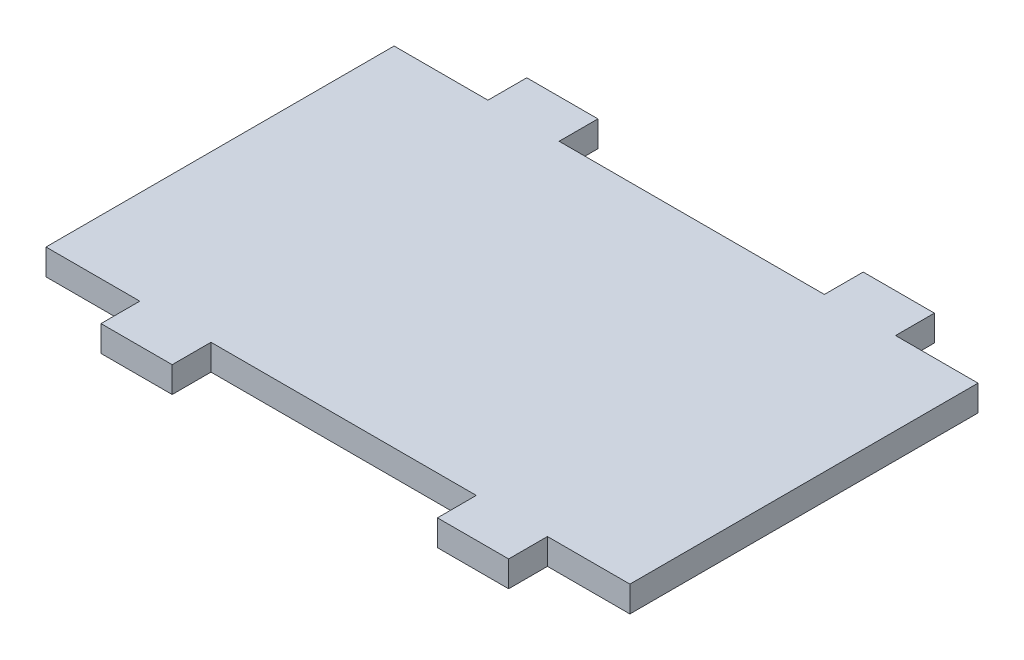
ISO-10303-21;
HEADER;
FILE_DESCRIPTION(('STEP AP214'),'2;1');
FILE_NAME('part.step','',(''),(''),'','','');
FILE_SCHEMA(('AUTOMOTIVE_DESIGN { 1 0 10303 214 1 1 1 1 }'));
ENDSEC;
DATA;
#1=APPLICATION_CONTEXT('core data for automotive mechanical design processes');
#2=APPLICATION_PROTOCOL_DEFINITION('international standard','automotive_design',2000,#1);
#3=PRODUCT_CONTEXT('',#1,'mechanical');
#4=PRODUCT('Part','Part','',(#3));
#5=PRODUCT_RELATED_PRODUCT_CATEGORY('part','',(#4));
#6=PRODUCT_DEFINITION_FORMATION('','',#4);
#7=PRODUCT_DEFINITION_CONTEXT('part definition',#1,'design');
#8=PRODUCT_DEFINITION('design','',#6,#7);
#9=PRODUCT_DEFINITION_SHAPE('','',#8);
#10=(LENGTH_UNIT() NAMED_UNIT(*) SI_UNIT(.MILLI.,.METRE.));
#11=(NAMED_UNIT(*) PLANE_ANGLE_UNIT() SI_UNIT($,.RADIAN.));
#12=(NAMED_UNIT(*) SI_UNIT($,.STERADIAN.) SOLID_ANGLE_UNIT());
#13=UNCERTAINTY_MEASURE_WITH_UNIT(LENGTH_MEASURE(1.E-05),#10,'distance_accuracy_value','');
#14=(GEOMETRIC_REPRESENTATION_CONTEXT(3) GLOBAL_UNCERTAINTY_ASSIGNED_CONTEXT((#13)) GLOBAL_UNIT_ASSIGNED_CONTEXT((#10,
#11,#12)) REPRESENTATION_CONTEXT('',''));
#15=CARTESIAN_POINT('',(0.,0.,0.));
#16=DIRECTION('',(0.,0.,1.));
#17=DIRECTION('',(1.,0.,0.));
#18=AXIS2_PLACEMENT_3D('',#15,#16,#17);
#19=CARTESIAN_POINT('',(-50.7984236509872,1.,18.7804542334295));
#20=DIRECTION('',(0.,0.,-1.));
#21=DIRECTION('',(-1.,0.,0.));
#22=AXIS2_PLACEMENT_3D('',#19,#20,#21);
#23=PLANE('',#22);
#24=DIRECTION('',(0.,-1.,0.));
#25=VECTOR('',#24,1.);
#26=CARTESIAN_POINT('',(-34.1734236509872,1.,18.7804542334295));
#27=LINE('',#26,#25);
#28=CARTESIAN_POINT('',(-34.1734236509872,1.,18.7804542334295));
#29=VERTEX_POINT('',#28);
#30=CARTESIAN_POINT('',(-34.1734236509872,0.,18.7804542334295));
#31=VERTEX_POINT('',#30);
#32=EDGE_CURVE('E58',#29,#31,#27,.T.);
#33=ORIENTED_EDGE('',*,*,#32,.F.);
#34=DIRECTION('',(1.,0.,0.));
#35=VECTOR('',#34,1.);
#36=CARTESIAN_POINT('',(-50.7984236509872,1.,18.7804542334295));
#37=LINE('',#36,#35);
#38=CARTESIAN_POINT('',(-44.4234236509872,1.,18.7804542334295));
#39=VERTEX_POINT('',#38);
#40=EDGE_CURVE('E190',#39,#29,#37,.T.);
#41=ORIENTED_EDGE('',*,*,#40,.F.);
#42=DIRECTION('',(0.,-1.,0.));
#43=VECTOR('',#42,1.);
#44=CARTESIAN_POINT('',(-44.4234236509872,1.,18.7804542334295));
#45=LINE('',#44,#43);
#46=CARTESIAN_POINT('',(-44.4234236509872,0.,18.7804542334295));
#47=VERTEX_POINT('',#46);
#48=EDGE_CURVE('E244',#39,#47,#45,.T.);
#49=ORIENTED_EDGE('',*,*,#48,.T.);
#50=DIRECTION('',(1.,0.,0.));
#51=VECTOR('',#50,1.);
#52=CARTESIAN_POINT('',(-50.7984236509872,0.,18.7804542334295));
#53=LINE('',#52,#51);
#54=EDGE_CURVE('E308',#47,#31,#53,.T.);
#55=ORIENTED_EDGE('',*,*,#54,.T.);
#56=EDGE_LOOP('',(#33,#41,#49,#55));
#57=FACE_BOUND('',#56,.T.);
#58=ADVANCED_FACE('F33',(#57),#23,.F.);
#59=DIRECTION('',(0.,-1.,0.));
#60=VECTOR('',#59,1.);
#61=CARTESIAN_POINT('',(-31.4234236509872,1.,18.7804542334295));
#62=LINE('',#61,#60);
#63=CARTESIAN_POINT('',(-31.4234236509872,1.,18.7804542334295));
#64=VERTEX_POINT('',#63);
#65=CARTESIAN_POINT('',(-31.4234236509872,0.,18.7804542334295));
#66=VERTEX_POINT('',#65);
#67=EDGE_CURVE('E201',#64,#66,#62,.T.);
#68=ORIENTED_EDGE('',*,*,#67,.T.);
#69=CARTESIAN_POINT('',(-28.2384236509872,0.,18.7804542334295));
#70=VERTEX_POINT('',#69);
#71=EDGE_CURVE('E302',#66,#70,#53,.T.);
#72=ORIENTED_EDGE('',*,*,#71,.T.);
#73=DIRECTION('',(0.,-1.,0.));
#74=VECTOR('',#73,1.);
#75=CARTESIAN_POINT('',(-28.2384236509872,1.,18.7804542334295));
#76=LINE('',#75,#74);
#77=CARTESIAN_POINT('',(-28.2384236509872,1.,18.7804542334295));
#78=VERTEX_POINT('',#77);
#79=EDGE_CURVE('E43',#78,#70,#76,.T.);
#80=ORIENTED_EDGE('',*,*,#79,.F.);
#81=EDGE_CURVE('E37',#64,#78,#37,.T.);
#82=ORIENTED_EDGE('',*,*,#81,.F.);
#83=EDGE_LOOP('',(#68,#72,#80,#82));
#84=FACE_BOUND('',#83,.T.);
#85=ADVANCED_FACE('F387',(#84),#23,.F.);
#86=CARTESIAN_POINT('',(-50.7984236509872,1.,5.33045423342954));
#87=DIRECTION('',(0.,0.,1.));
#88=DIRECTION('',(1.,0.,0.));
#89=AXIS2_PLACEMENT_3D('',#86,#87,#88);
#90=PLANE('',#89);
#91=DIRECTION('',(0.,-1.,0.));
#92=VECTOR('',#91,1.);
#93=CARTESIAN_POINT('',(-31.4234236509872,1.,5.33045423342954));
#94=LINE('',#93,#92);
#95=CARTESIAN_POINT('',(-31.4234236509872,1.,5.33045423342954));
#96=VERTEX_POINT('',#95);
#97=CARTESIAN_POINT('',(-31.4234236509872,0.,5.33045423342954));
#98=VERTEX_POINT('',#97);
#99=EDGE_CURVE('E225',#96,#98,#94,.T.);
#100=ORIENTED_EDGE('',*,*,#99,.F.);
#101=DIRECTION('',(-1.,0.,0.));
#102=VECTOR('',#101,1.);
#103=CARTESIAN_POINT('',(-50.7984236509872,1.,5.33045423342954));
#104=LINE('',#103,#102);
#105=CARTESIAN_POINT('',(-28.2384236509872,1.,5.33045423342954));
#106=VERTEX_POINT('',#105);
#107=EDGE_CURVE('E284',#106,#96,#104,.T.);
#108=ORIENTED_EDGE('',*,*,#107,.F.);
#109=DIRECTION('',(0.,-1.,0.));
#110=VECTOR('',#109,1.);
#111=CARTESIAN_POINT('',(-28.2384236509872,1.,5.33045423342954));
#112=LINE('',#111,#110);
#113=CARTESIAN_POINT('',(-28.2384236509872,0.,5.33045423342954));
#114=VERTEX_POINT('',#113);
#115=EDGE_CURVE('E277',#106,#114,#112,.T.);
#116=ORIENTED_EDGE('',*,*,#115,.T.);
#117=DIRECTION('',(-1.,0.,0.));
#118=VECTOR('',#117,1.);
#119=CARTESIAN_POINT('',(-50.7984236509872,0.,5.33045423342954));
#120=LINE('',#119,#118);
#121=EDGE_CURVE('E258',#114,#98,#120,.T.);
#122=ORIENTED_EDGE('',*,*,#121,.T.);
#123=EDGE_LOOP('',(#100,#108,#116,#122));
#124=FACE_BOUND('',#123,.T.);
#125=ADVANCED_FACE('F392',(#124),#90,.F.);
#126=DIRECTION('',(0.,-1.,0.));
#127=VECTOR('',#126,1.);
#128=CARTESIAN_POINT('',(-34.1734236509872,1.,5.33045423342954));
#129=LINE('',#128,#127);
#130=CARTESIAN_POINT('',(-34.1734236509872,1.,5.33045423342954));
#131=VERTEX_POINT('',#130);
#132=CARTESIAN_POINT('',(-34.1734236509872,0.,5.33045423342954));
#133=VERTEX_POINT('',#132);
#134=EDGE_CURVE('E212',#131,#133,#129,.T.);
#135=ORIENTED_EDGE('',*,*,#134,.T.);
#136=CARTESIAN_POINT('',(-44.4234236509872,0.,5.33045423342954));
#137=VERTEX_POINT('',#136);
#138=EDGE_CURVE('E255',#133,#137,#120,.T.);
#139=ORIENTED_EDGE('',*,*,#138,.T.);
#140=DIRECTION('',(0.,-1.,0.));
#141=VECTOR('',#140,1.);
#142=CARTESIAN_POINT('',(-44.4234236509872,1.,5.33045423342954));
#143=LINE('',#142,#141);
#144=CARTESIAN_POINT('',(-44.4234236509872,1.,5.33045423342954));
#145=VERTEX_POINT('',#144);
#146=EDGE_CURVE('E326',#145,#137,#143,.T.);
#147=ORIENTED_EDGE('',*,*,#146,.F.);
#148=EDGE_CURVE('E260',#131,#145,#104,.T.);
#149=ORIENTED_EDGE('',*,*,#148,.F.);
#150=EDGE_LOOP('',(#135,#139,#147,#149));
#151=FACE_BOUND('',#150,.T.);
#152=ADVANCED_FACE('F395',(#151),#90,.F.);
#153=DIRECTION('',(0.,-1.,0.));
#154=VECTOR('',#153,1.);
#155=CARTESIAN_POINT('',(-47.1734236509872,1.,18.7804542334295));
#156=LINE('',#155,#154);
#157=CARTESIAN_POINT('',(-47.1734236509872,1.,18.7804542334295));
#158=VERTEX_POINT('',#157);
#159=CARTESIAN_POINT('',(-47.1734236509872,0.,18.7804542334295));
#160=VERTEX_POINT('',#159);
#161=EDGE_CURVE('E241',#158,#160,#156,.T.);
#162=ORIENTED_EDGE('',*,*,#161,.F.);
#163=CARTESIAN_POINT('',(-50.7984236509872,1.,18.7804542334295));
#164=VERTEX_POINT('',#163);
#165=EDGE_CURVE('E365',#164,#158,#37,.T.);
#166=ORIENTED_EDGE('',*,*,#165,.F.);
#167=DIRECTION('',(0.,-1.,0.));
#168=VECTOR('',#167,1.);
#169=CARTESIAN_POINT('',(-50.7984236509872,1.,18.7804542334295));
#170=LINE('',#169,#168);
#171=CARTESIAN_POINT('',(-50.7984236509872,0.,18.7804542334295));
#172=VERTEX_POINT('',#171);
#173=EDGE_CURVE('E11',#164,#172,#170,.T.);
#174=ORIENTED_EDGE('',*,*,#173,.T.);
#175=EDGE_CURVE('E311',#172,#160,#53,.T.);
#176=ORIENTED_EDGE('',*,*,#175,.T.);
#177=EDGE_LOOP('',(#162,#166,#174,#176));
#178=FACE_BOUND('',#177,.T.);
#179=ADVANCED_FACE('F388',(#178),#23,.F.);
#180=CARTESIAN_POINT('',(-50.7984236509872,1.,5.33045423342954));
#181=DIRECTION('',(1.,0.,0.));
#182=DIRECTION('',(0.,0.,-1.));
#183=AXIS2_PLACEMENT_3D('',#180,#181,#182);
#184=PLANE('',#183);
#185=DIRECTION('',(0.,0.,1.));
#186=VECTOR('',#185,1.);
#187=CARTESIAN_POINT('',(-50.7984236509872,0.,5.33045423342954));
#188=LINE('',#187,#186);
#189=CARTESIAN_POINT('',(-50.7984236509872,0.,5.33045423342954));
#190=VERTEX_POINT('',#189);
#191=EDGE_CURVE('E299',#190,#172,#188,.T.);
#192=ORIENTED_EDGE('',*,*,#191,.T.);
#193=ORIENTED_EDGE('',*,*,#173,.F.);
#194=DIRECTION('',(0.,0.,1.));
#195=VECTOR('',#194,1.);
#196=CARTESIAN_POINT('',(-50.7984236509872,1.,5.33045423342954));
#197=LINE('',#196,#195);
#198=CARTESIAN_POINT('',(-50.7984236509872,1.,5.33045423342954));
#199=VERTEX_POINT('',#198);
#200=EDGE_CURVE('E274',#199,#164,#197,.T.);
#201=ORIENTED_EDGE('',*,*,#200,.F.);
#202=DIRECTION('',(0.,-1.,0.));
#203=VECTOR('',#202,1.);
#204=CARTESIAN_POINT('',(-50.7984236509872,1.,5.33045423342954));
#205=LINE('',#204,#203);
#206=EDGE_CURVE('E267',#199,#190,#205,.T.);
#207=ORIENTED_EDGE('',*,*,#206,.T.);
#208=EDGE_LOOP('',(#192,#193,#201,#207));
#209=FACE_BOUND('',#208,.T.);
#210=ADVANCED_FACE('F35',(#209),#184,.F.);
#211=CARTESIAN_POINT('',(-28.2384236509872,1.,5.33045423342954));
#212=DIRECTION('',(-1.,0.,0.));
#213=DIRECTION('',(0.,0.,1.));
#214=AXIS2_PLACEMENT_3D('',#211,#212,#213);
#215=PLANE('',#214);
#216=DIRECTION('',(0.,0.,-1.));
#217=VECTOR('',#216,1.);
#218=CARTESIAN_POINT('',(-28.2384236509872,0.,5.33045423342954));
#219=LINE('',#218,#217);
#220=EDGE_CURVE('E265',#70,#114,#219,.T.);
#221=ORIENTED_EDGE('',*,*,#220,.T.);
#222=ORIENTED_EDGE('',*,*,#115,.F.);
#223=DIRECTION('',(0.,0.,-1.));
#224=VECTOR('',#223,1.);
#225=CARTESIAN_POINT('',(-28.2384236509872,1.,5.33045423342954));
#226=LINE('',#225,#224);
#227=EDGE_CURVE('E298',#78,#106,#226,.T.);
#228=ORIENTED_EDGE('',*,*,#227,.F.);
#229=ORIENTED_EDGE('',*,*,#79,.T.);
#230=EDGE_LOOP('',(#221,#222,#228,#229));
#231=FACE_BOUND('',#230,.T.);
#232=ADVANCED_FACE('F401',(#231),#215,.F.);
#233=CARTESIAN_POINT('',(-47.1734236509872,1.,5.33045423342954));
#234=VERTEX_POINT('',#233);
#235=EDGE_CURVE('E292',#234,#199,#104,.T.);
#236=ORIENTED_EDGE('',*,*,#235,.F.);
#237=DIRECTION('',(0.,-1.,0.));
#238=VECTOR('',#237,1.);
#239=CARTESIAN_POINT('',(-47.1734236509872,1.,5.33045423342954));
#240=LINE('',#239,#238);
#241=CARTESIAN_POINT('',(-47.1734236509872,0.,5.33045423342954));
#242=VERTEX_POINT('',#241);
#243=EDGE_CURVE('E303',#234,#242,#240,.T.);
#244=ORIENTED_EDGE('',*,*,#243,.T.);
#245=EDGE_CURVE('E259',#242,#190,#120,.T.);
#246=ORIENTED_EDGE('',*,*,#245,.T.);
#247=ORIENTED_EDGE('',*,*,#206,.F.);
#248=EDGE_LOOP('',(#236,#244,#246,#247));
#249=FACE_BOUND('',#248,.T.);
#250=ADVANCED_FACE('F364',(#249),#90,.F.);
#251=CARTESIAN_POINT('',(0.,1.,0.));
#252=DIRECTION('',(0.,1.,0.));
#253=DIRECTION('',(0.,0.,1.));
#254=AXIS2_PLACEMENT_3D('',#251,#252,#253);
#255=PLANE('',#254);
#256=ORIENTED_EDGE('',*,*,#200,.T.);
#257=ORIENTED_EDGE('',*,*,#165,.T.);
#258=DIRECTION('',(0.,0.,1.));
#259=VECTOR('',#258,1.);
#260=CARTESIAN_POINT('',(-47.1734236509872,1.,18.7804542334295));
#261=LINE('',#260,#259);
#262=CARTESIAN_POINT('',(-47.1734236509872,1.,20.2804542334295));
#263=VERTEX_POINT('',#262);
#264=EDGE_CURVE('E232',#158,#263,#261,.T.);
#265=ORIENTED_EDGE('',*,*,#264,.T.);
#266=DIRECTION('',(1.,0.,0.));
#267=VECTOR('',#266,1.);
#268=CARTESIAN_POINT('',(-47.1734236509872,1.,20.2804542334295));
#269=LINE('',#268,#267);
#270=CARTESIAN_POINT('',(-44.4234236509872,1.,20.2804542334295));
#271=VERTEX_POINT('',#270);
#272=EDGE_CURVE('E229',#263,#271,#269,.T.);
#273=ORIENTED_EDGE('',*,*,#272,.T.);
#274=DIRECTION('',(0.,0.,-1.));
#275=VECTOR('',#274,1.);
#276=CARTESIAN_POINT('',(-44.4234236509872,1.,18.7804542334295));
#277=LINE('',#276,#275);
#278=EDGE_CURVE('E231',#271,#39,#277,.T.);
#279=ORIENTED_EDGE('',*,*,#278,.T.);
#280=ORIENTED_EDGE('',*,*,#40,.T.);
#281=DIRECTION('',(0.,0.,1.));
#282=VECTOR('',#281,1.);
#283=CARTESIAN_POINT('',(-34.1734236509872,1.,18.7804542334295));
#284=LINE('',#283,#282);
#285=CARTESIAN_POINT('',(-34.1734236509872,1.,20.2804542334295));
#286=VERTEX_POINT('',#285);
#287=EDGE_CURVE('E185',#29,#286,#284,.T.);
#288=ORIENTED_EDGE('',*,*,#287,.T.);
#289=DIRECTION('',(1.,0.,0.));
#290=VECTOR('',#289,1.);
#291=CARTESIAN_POINT('',(-34.1734236509872,1.,20.2804542334295));
#292=LINE('',#291,#290);
#293=CARTESIAN_POINT('',(-31.4234236509872,1.,20.2804542334295));
#294=VERTEX_POINT('',#293);
#295=EDGE_CURVE('E174',#286,#294,#292,.T.);
#296=ORIENTED_EDGE('',*,*,#295,.T.);
#297=DIRECTION('',(0.,0.,-1.));
#298=VECTOR('',#297,1.);
#299=CARTESIAN_POINT('',(-31.4234236509872,1.,18.7804542334295));
#300=LINE('',#299,#298);
#301=EDGE_CURVE('E184',#294,#64,#300,.T.);
#302=ORIENTED_EDGE('',*,*,#301,.T.);
#303=ORIENTED_EDGE('',*,*,#81,.T.);
#304=ORIENTED_EDGE('',*,*,#227,.T.);
#305=ORIENTED_EDGE('',*,*,#107,.T.);
#306=DIRECTION('',(0.,0.,-1.));
#307=VECTOR('',#306,1.);
#308=CARTESIAN_POINT('',(-31.4234236509872,1.,5.33045423342954));
#309=LINE('',#308,#307);
#310=CARTESIAN_POINT('',(-31.4234236509872,1.,3.83045423342955));
#311=VERTEX_POINT('',#310);
#312=EDGE_CURVE('E205',#96,#311,#309,.T.);
#313=ORIENTED_EDGE('',*,*,#312,.T.);
#314=DIRECTION('',(-1.,0.,0.));
#315=VECTOR('',#314,1.);
#316=CARTESIAN_POINT('',(-34.1734236509872,1.,3.83045423342955));
#317=LINE('',#316,#315);
#318=CARTESIAN_POINT('',(-34.1734236509872,1.,3.83045423342955));
#319=VERTEX_POINT('',#318);
#320=EDGE_CURVE('E207',#311,#319,#317,.T.);
#321=ORIENTED_EDGE('',*,*,#320,.T.);
#322=DIRECTION('',(0.,0.,1.));
#323=VECTOR('',#322,1.);
#324=CARTESIAN_POINT('',(-34.1734236509872,1.,5.33045423342954));
#325=LINE('',#324,#323);
#326=EDGE_CURVE('E210',#319,#131,#325,.T.);
#327=ORIENTED_EDGE('',*,*,#326,.T.);
#328=ORIENTED_EDGE('',*,*,#148,.T.);
#329=DIRECTION('',(0.,0.,-1.));
#330=VECTOR('',#329,1.);
#331=CARTESIAN_POINT('',(-44.4234236509872,1.,5.33045423342954));
#332=LINE('',#331,#330);
#333=CARTESIAN_POINT('',(-44.4234236509872,1.,3.83045423342955));
#334=VERTEX_POINT('',#333);
#335=EDGE_CURVE('E322',#145,#334,#332,.T.);
#336=ORIENTED_EDGE('',*,*,#335,.T.);
#337=DIRECTION('',(-1.,0.,0.));
#338=VECTOR('',#337,1.);
#339=CARTESIAN_POINT('',(-47.1734236509872,1.,3.83045423342955));
#340=LINE('',#339,#338);
#341=CARTESIAN_POINT('',(-47.1734236509872,1.,3.83045423342955));
#342=VERTEX_POINT('',#341);
#343=EDGE_CURVE('E324',#334,#342,#340,.T.);
#344=ORIENTED_EDGE('',*,*,#343,.T.);
#345=DIRECTION('',(0.,0.,1.));
#346=VECTOR('',#345,1.);
#347=CARTESIAN_POINT('',(-47.1734236509872,1.,5.33045423342954));
#348=LINE('',#347,#346);
#349=EDGE_CURVE('E325',#342,#234,#348,.T.);
#350=ORIENTED_EDGE('',*,*,#349,.T.);
#351=ORIENTED_EDGE('',*,*,#235,.T.);
#352=EDGE_LOOP('',(#256,#257,#265,#273,#279,#280,#288,#296,#302,#303,#304,#305,#313,#321,#327,
#328,#336,#344,#350,#351));
#353=FACE_BOUND('',#352,.T.);
#354=ADVANCED_FACE('F189',(#353),#255,.T.);
#355=CARTESIAN_POINT('',(0.,0.,0.));
#356=DIRECTION('',(0.,1.,0.));
#357=DIRECTION('',(0.,0.,1.));
#358=AXIS2_PLACEMENT_3D('',#355,#356,#357);
#359=PLANE('',#358);
#360=ORIENTED_EDGE('',*,*,#191,.F.);
#361=ORIENTED_EDGE('',*,*,#245,.F.);
#362=DIRECTION('',(0.,0.,1.));
#363=VECTOR('',#362,1.);
#364=CARTESIAN_POINT('',(-47.1734236509872,0.,5.33045423342954));
#365=LINE('',#364,#363);
#366=CARTESIAN_POINT('',(-47.1734236509872,0.,3.83045423342955));
#367=VERTEX_POINT('',#366);
#368=EDGE_CURVE('E319',#367,#242,#365,.T.);
#369=ORIENTED_EDGE('',*,*,#368,.F.);
#370=DIRECTION('',(-1.,0.,0.));
#371=VECTOR('',#370,1.);
#372=CARTESIAN_POINT('',(-47.1734236509872,0.,3.83045423342955));
#373=LINE('',#372,#371);
#374=CARTESIAN_POINT('',(-44.4234236509872,0.,3.83045423342955));
#375=VERTEX_POINT('',#374);
#376=EDGE_CURVE('E318',#375,#367,#373,.T.);
#377=ORIENTED_EDGE('',*,*,#376,.F.);
#378=DIRECTION('',(0.,0.,-1.));
#379=VECTOR('',#378,1.);
#380=CARTESIAN_POINT('',(-44.4234236509872,0.,5.33045423342954));
#381=LINE('',#380,#379);
#382=EDGE_CURVE('E316',#137,#375,#381,.T.);
#383=ORIENTED_EDGE('',*,*,#382,.F.);
#384=ORIENTED_EDGE('',*,*,#138,.F.);
#385=DIRECTION('',(0.,0.,1.));
#386=VECTOR('',#385,1.);
#387=CARTESIAN_POINT('',(-34.1734236509872,0.,5.33045423342954));
#388=LINE('',#387,#386);
#389=CARTESIAN_POINT('',(-34.1734236509872,0.,3.83045423342955));
#390=VERTEX_POINT('',#389);
#391=EDGE_CURVE('E208',#390,#133,#388,.T.);
#392=ORIENTED_EDGE('',*,*,#391,.F.);
#393=DIRECTION('',(-1.,0.,0.));
#394=VECTOR('',#393,1.);
#395=CARTESIAN_POINT('',(-34.1734236509872,0.,3.83045423342955));
#396=LINE('',#395,#394);
#397=CARTESIAN_POINT('',(-31.4234236509872,0.,3.83045423342955));
#398=VERTEX_POINT('',#397);
#399=EDGE_CURVE('E199',#398,#390,#396,.T.);
#400=ORIENTED_EDGE('',*,*,#399,.F.);
#401=DIRECTION('',(0.,0.,-1.));
#402=VECTOR('',#401,1.);
#403=CARTESIAN_POINT('',(-31.4234236509872,0.,5.33045423342954));
#404=LINE('',#403,#402);
#405=EDGE_CURVE('E197',#98,#398,#404,.T.);
#406=ORIENTED_EDGE('',*,*,#405,.F.);
#407=ORIENTED_EDGE('',*,*,#121,.F.);
#408=ORIENTED_EDGE('',*,*,#220,.F.);
#409=ORIENTED_EDGE('',*,*,#71,.F.);
#410=DIRECTION('',(0.,0.,-1.));
#411=VECTOR('',#410,1.);
#412=CARTESIAN_POINT('',(-31.4234236509872,0.,18.7804542334295));
#413=LINE('',#412,#411);
#414=CARTESIAN_POINT('',(-31.4234236509872,0.,20.2804542334295));
#415=VERTEX_POINT('',#414);
#416=EDGE_CURVE('E192',#415,#66,#413,.T.);
#417=ORIENTED_EDGE('',*,*,#416,.F.);
#418=DIRECTION('',(1.,0.,0.));
#419=VECTOR('',#418,1.);
#420=CARTESIAN_POINT('',(-34.1734236509872,0.,20.2804542334295));
#421=LINE('',#420,#419);
#422=CARTESIAN_POINT('',(-34.1734236509872,0.,20.2804542334295));
#423=VERTEX_POINT('',#422);
#424=EDGE_CURVE('E448',#423,#415,#421,.T.);
#425=ORIENTED_EDGE('',*,*,#424,.F.);
#426=DIRECTION('',(0.,0.,1.));
#427=VECTOR('',#426,1.);
#428=CARTESIAN_POINT('',(-34.1734236509872,0.,18.7804542334295));
#429=LINE('',#428,#427);
#430=EDGE_CURVE('E196',#31,#423,#429,.T.);
#431=ORIENTED_EDGE('',*,*,#430,.F.);
#432=ORIENTED_EDGE('',*,*,#54,.F.);
#433=DIRECTION('',(0.,0.,-1.));
#434=VECTOR('',#433,1.);
#435=CARTESIAN_POINT('',(-44.4234236509872,0.,18.7804542334295));
#436=LINE('',#435,#434);
#437=CARTESIAN_POINT('',(-44.4234236509872,0.,20.2804542334295));
#438=VERTEX_POINT('',#437);
#439=EDGE_CURVE('E235',#438,#47,#436,.T.);
#440=ORIENTED_EDGE('',*,*,#439,.F.);
#441=DIRECTION('',(1.,0.,0.));
#442=VECTOR('',#441,1.);
#443=CARTESIAN_POINT('',(-47.1734236509872,0.,20.2804542334295));
#444=LINE('',#443,#442);
#445=CARTESIAN_POINT('',(-47.1734236509872,0.,20.2804542334295));
#446=VERTEX_POINT('',#445);
#447=EDGE_CURVE('E233',#446,#438,#444,.T.);
#448=ORIENTED_EDGE('',*,*,#447,.F.);
#449=DIRECTION('',(0.,0.,1.));
#450=VECTOR('',#449,1.);
#451=CARTESIAN_POINT('',(-47.1734236509872,0.,18.7804542334295));
#452=LINE('',#451,#450);
#453=EDGE_CURVE('E228',#160,#446,#452,.T.);
#454=ORIENTED_EDGE('',*,*,#453,.F.);
#455=ORIENTED_EDGE('',*,*,#175,.F.);
#456=EDGE_LOOP('',(#360,#361,#369,#377,#383,#384,#392,#400,#406,#407,#408,#409,#417,#425,#431,
#432,#440,#448,#454,#455));
#457=FACE_BOUND('',#456,.T.);
#458=ADVANCED_FACE('F410',(#457),#359,.F.);
#459=CARTESIAN_POINT('',(-47.1734236509872,1.,5.33045423342954));
#460=DIRECTION('',(1.,0.,0.));
#461=DIRECTION('',(0.,0.,-1.));
#462=AXIS2_PLACEMENT_3D('',#459,#460,#461);
#463=PLANE('',#462);
#464=ORIENTED_EDGE('',*,*,#368,.T.);
#465=ORIENTED_EDGE('',*,*,#243,.F.);
#466=ORIENTED_EDGE('',*,*,#349,.F.);
#467=DIRECTION('',(0.,-1.,0.));
#468=VECTOR('',#467,1.);
#469=CARTESIAN_POINT('',(-47.1734236509872,1.,3.83045423342955));
#470=LINE('',#469,#468);
#471=EDGE_CURVE('E353',#342,#367,#470,.T.);
#472=ORIENTED_EDGE('',*,*,#471,.T.);
#473=EDGE_LOOP('',(#464,#465,#466,#472));
#474=FACE_BOUND('',#473,.T.);
#475=ADVANCED_FACE('F360',(#474),#463,.F.);
#476=CARTESIAN_POINT('',(-44.4234236509872,1.,5.33045423342954));
#477=DIRECTION('',(-1.,0.,0.));
#478=DIRECTION('',(0.,0.,1.));
#479=AXIS2_PLACEMENT_3D('',#476,#477,#478);
#480=PLANE('',#479);
#481=ORIENTED_EDGE('',*,*,#382,.T.);
#482=DIRECTION('',(0.,-1.,0.));
#483=VECTOR('',#482,1.);
#484=CARTESIAN_POINT('',(-44.4234236509872,1.,3.83045423342955));
#485=LINE('',#484,#483);
#486=EDGE_CURVE('E330',#334,#375,#485,.T.);
#487=ORIENTED_EDGE('',*,*,#486,.F.);
#488=ORIENTED_EDGE('',*,*,#335,.F.);
#489=ORIENTED_EDGE('',*,*,#146,.T.);
#490=EDGE_LOOP('',(#481,#487,#488,#489));
#491=FACE_BOUND('',#490,.T.);
#492=ADVANCED_FACE('F428',(#491),#480,.F.);
#493=CARTESIAN_POINT('',(-47.1734236509872,1.,3.83045423342955));
#494=DIRECTION('',(0.,0.,1.));
#495=DIRECTION('',(1.,0.,0.));
#496=AXIS2_PLACEMENT_3D('',#493,#494,#495);
#497=PLANE('',#496);
#498=ORIENTED_EDGE('',*,*,#376,.T.);
#499=ORIENTED_EDGE('',*,*,#471,.F.);
#500=ORIENTED_EDGE('',*,*,#343,.F.);
#501=ORIENTED_EDGE('',*,*,#486,.T.);
#502=EDGE_LOOP('',(#498,#499,#500,#501));
#503=FACE_BOUND('',#502,.T.);
#504=ADVANCED_FACE('F359',(#503),#497,.F.);
#505=CARTESIAN_POINT('',(-47.1734236509872,1.,18.7804542334295));
#506=DIRECTION('',(1.,0.,0.));
#507=DIRECTION('',(0.,0.,-1.));
#508=AXIS2_PLACEMENT_3D('',#505,#506,#507);
#509=PLANE('',#508);
#510=ORIENTED_EDGE('',*,*,#453,.T.);
#511=DIRECTION('',(0.,-1.,0.));
#512=VECTOR('',#511,1.);
#513=CARTESIAN_POINT('',(-47.1734236509872,1.,20.2804542334295));
#514=LINE('',#513,#512);
#515=EDGE_CURVE('E413',#263,#446,#514,.T.);
#516=ORIENTED_EDGE('',*,*,#515,.F.);
#517=ORIENTED_EDGE('',*,*,#264,.F.);
#518=ORIENTED_EDGE('',*,*,#161,.T.);
#519=EDGE_LOOP('',(#510,#516,#517,#518));
#520=FACE_BOUND('',#519,.T.);
#521=ADVANCED_FACE('F407',(#520),#509,.F.);
#522=CARTESIAN_POINT('',(-47.1734236509872,1.,20.2804542334295));
#523=DIRECTION('',(0.,0.,-1.));
#524=DIRECTION('',(-1.,0.,0.));
#525=AXIS2_PLACEMENT_3D('',#522,#523,#524);
#526=PLANE('',#525);
#527=ORIENTED_EDGE('',*,*,#447,.T.);
#528=DIRECTION('',(0.,-1.,0.));
#529=VECTOR('',#528,1.);
#530=CARTESIAN_POINT('',(-44.4234236509872,1.,20.2804542334295));
#531=LINE('',#530,#529);
#532=EDGE_CURVE('E375',#271,#438,#531,.T.);
#533=ORIENTED_EDGE('',*,*,#532,.F.);
#534=ORIENTED_EDGE('',*,*,#272,.F.);
#535=ORIENTED_EDGE('',*,*,#515,.T.);
#536=EDGE_LOOP('',(#527,#533,#534,#535));
#537=FACE_BOUND('',#536,.T.);
#538=ADVANCED_FACE('F414',(#537),#526,.F.);
#539=CARTESIAN_POINT('',(-44.4234236509872,1.,18.7804542334295));
#540=DIRECTION('',(-1.,0.,0.));
#541=DIRECTION('',(0.,0.,1.));
#542=AXIS2_PLACEMENT_3D('',#539,#540,#541);
#543=PLANE('',#542);
#544=ORIENTED_EDGE('',*,*,#439,.T.);
#545=ORIENTED_EDGE('',*,*,#48,.F.);
#546=ORIENTED_EDGE('',*,*,#278,.F.);
#547=ORIENTED_EDGE('',*,*,#532,.T.);
#548=EDGE_LOOP('',(#544,#545,#546,#547));
#549=FACE_BOUND('',#548,.T.);
#550=ADVANCED_FACE('F383',(#549),#543,.F.);
#551=CARTESIAN_POINT('',(-31.4234236509872,1.,5.33045423342954));
#552=DIRECTION('',(-1.,0.,0.));
#553=DIRECTION('',(0.,0.,1.));
#554=AXIS2_PLACEMENT_3D('',#551,#552,#553);
#555=PLANE('',#554);
#556=ORIENTED_EDGE('',*,*,#405,.T.);
#557=DIRECTION('',(0.,-1.,0.));
#558=VECTOR('',#557,1.);
#559=CARTESIAN_POINT('',(-31.4234236509872,1.,3.83045423342955));
#560=LINE('',#559,#558);
#561=EDGE_CURVE('E222',#311,#398,#560,.T.);
#562=ORIENTED_EDGE('',*,*,#561,.F.);
#563=ORIENTED_EDGE('',*,*,#312,.F.);
#564=ORIENTED_EDGE('',*,*,#99,.T.);
#565=EDGE_LOOP('',(#556,#562,#563,#564));
#566=FACE_BOUND('',#565,.T.);
#567=ADVANCED_FACE('F421',(#566),#555,.F.);
#568=CARTESIAN_POINT('',(-34.1734236509872,1.,3.83045423342955));
#569=DIRECTION('',(0.,0.,1.));
#570=DIRECTION('',(1.,0.,0.));
#571=AXIS2_PLACEMENT_3D('',#568,#569,#570);
#572=PLANE('',#571);
#573=ORIENTED_EDGE('',*,*,#399,.T.);
#574=DIRECTION('',(0.,-1.,0.));
#575=VECTOR('',#574,1.);
#576=CARTESIAN_POINT('',(-34.1734236509872,1.,3.83045423342955));
#577=LINE('',#576,#575);
#578=EDGE_CURVE('E219',#319,#390,#577,.T.);
#579=ORIENTED_EDGE('',*,*,#578,.F.);
#580=ORIENTED_EDGE('',*,*,#320,.F.);
#581=ORIENTED_EDGE('',*,*,#561,.T.);
#582=EDGE_LOOP('',(#573,#579,#580,#581));
#583=FACE_BOUND('',#582,.T.);
#584=ADVANCED_FACE('F467',(#583),#572,.F.);
#585=CARTESIAN_POINT('',(-34.1734236509872,1.,5.33045423342954));
#586=DIRECTION('',(1.,0.,0.));
#587=DIRECTION('',(0.,0.,-1.));
#588=AXIS2_PLACEMENT_3D('',#585,#586,#587);
#589=PLANE('',#588);
#590=ORIENTED_EDGE('',*,*,#391,.T.);
#591=ORIENTED_EDGE('',*,*,#134,.F.);
#592=ORIENTED_EDGE('',*,*,#326,.F.);
#593=ORIENTED_EDGE('',*,*,#578,.T.);
#594=EDGE_LOOP('',(#590,#591,#592,#593));
#595=FACE_BOUND('',#594,.T.);
#596=ADVANCED_FACE('F464',(#595),#589,.F.);
#597=CARTESIAN_POINT('',(-34.1734236509872,1.,18.7804542334295));
#598=DIRECTION('',(1.,0.,0.));
#599=DIRECTION('',(0.,0.,-1.));
#600=AXIS2_PLACEMENT_3D('',#597,#598,#599);
#601=PLANE('',#600);
#602=ORIENTED_EDGE('',*,*,#430,.T.);
#603=DIRECTION('',(0.,-1.,0.));
#604=VECTOR('',#603,1.);
#605=CARTESIAN_POINT('',(-34.1734236509872,1.,20.2804542334295));
#606=LINE('',#605,#604);
#607=EDGE_CURVE('E178',#286,#423,#606,.T.);
#608=ORIENTED_EDGE('',*,*,#607,.F.);
#609=ORIENTED_EDGE('',*,*,#287,.F.);
#610=ORIENTED_EDGE('',*,*,#32,.T.);
#611=EDGE_LOOP('',(#602,#608,#609,#610));
#612=FACE_BOUND('',#611,.T.);
#613=ADVANCED_FACE('F194',(#612),#601,.F.);
#614=CARTESIAN_POINT('',(-34.1734236509872,1.,20.2804542334295));
#615=DIRECTION('',(0.,0.,-1.));
#616=DIRECTION('',(-1.,0.,0.));
#617=AXIS2_PLACEMENT_3D('',#614,#615,#616);
#618=PLANE('',#617);
#619=ORIENTED_EDGE('',*,*,#424,.T.);
#620=DIRECTION('',(0.,-1.,0.));
#621=VECTOR('',#620,1.);
#622=CARTESIAN_POINT('',(-31.4234236509872,1.,20.2804542334295));
#623=LINE('',#622,#621);
#624=EDGE_CURVE('E181',#294,#415,#623,.T.);
#625=ORIENTED_EDGE('',*,*,#624,.F.);
#626=ORIENTED_EDGE('',*,*,#295,.F.);
#627=ORIENTED_EDGE('',*,*,#607,.T.);
#628=EDGE_LOOP('',(#619,#625,#626,#627));
#629=FACE_BOUND('',#628,.T.);
#630=ADVANCED_FACE('F176',(#629),#618,.F.);
#631=CARTESIAN_POINT('',(-31.4234236509872,1.,18.7804542334295));
#632=DIRECTION('',(-1.,0.,0.));
#633=DIRECTION('',(0.,0.,1.));
#634=AXIS2_PLACEMENT_3D('',#631,#632,#633);
#635=PLANE('',#634);
#636=ORIENTED_EDGE('',*,*,#416,.T.);
#637=ORIENTED_EDGE('',*,*,#67,.F.);
#638=ORIENTED_EDGE('',*,*,#301,.F.);
#639=ORIENTED_EDGE('',*,*,#624,.T.);
#640=EDGE_LOOP('',(#636,#637,#638,#639));
#641=FACE_BOUND('',#640,.T.);
#642=ADVANCED_FACE('F454',(#641),#635,.F.);
#643=CLOSED_SHELL('',(#58,#85,#125,#152,#179,#210,#232,#250,#354,#458,#475,#492,#504,#521,#538,
#550,#567,#584,#596,#613,#630,#642));
#644=MANIFOLD_SOLID_BREP('B2',#643);
#645=ADVANCED_BREP_SHAPE_REPRESENTATION('',(#18,#644),#14);
#646=SHAPE_DEFINITION_REPRESENTATION(#9,#645);
ENDSEC;
END-ISO-10303-21;
